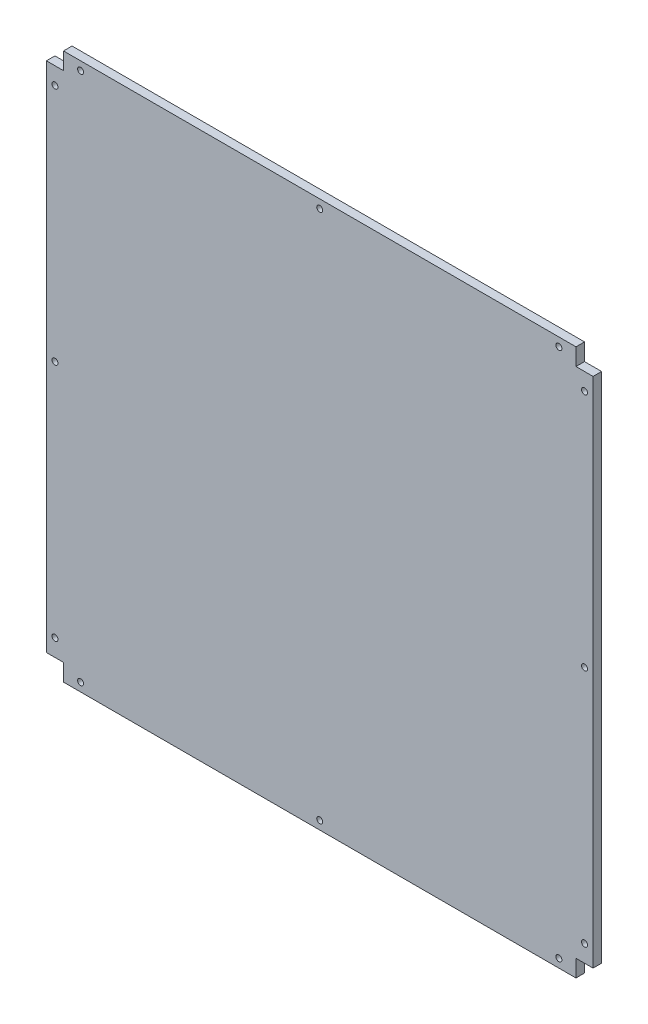
ISO-10303-21;
HEADER;
FILE_DESCRIPTION(('STEP AP214'),'2;1');
FILE_NAME('part.step','',(''),(''),'','','');
FILE_SCHEMA(('AUTOMOTIVE_DESIGN { 1 0 10303 214 1 1 1 1 }'));
ENDSEC;
DATA;
#1=APPLICATION_CONTEXT('core data for automotive mechanical design processes');
#2=APPLICATION_PROTOCOL_DEFINITION('international standard','automotive_design',2000,#1);
#3=PRODUCT_CONTEXT('',#1,'mechanical');
#4=PRODUCT('Part','Part','',(#3));
#5=PRODUCT_RELATED_PRODUCT_CATEGORY('part','',(#4));
#6=PRODUCT_DEFINITION_FORMATION('','',#4);
#7=PRODUCT_DEFINITION_CONTEXT('part definition',#1,'design');
#8=PRODUCT_DEFINITION('design','',#6,#7);
#9=PRODUCT_DEFINITION_SHAPE('','',#8);
#10=(LENGTH_UNIT() NAMED_UNIT(*) SI_UNIT(.MILLI.,.METRE.));
#11=(NAMED_UNIT(*) PLANE_ANGLE_UNIT() SI_UNIT($,.RADIAN.));
#12=(NAMED_UNIT(*) SI_UNIT($,.STERADIAN.) SOLID_ANGLE_UNIT());
#13=UNCERTAINTY_MEASURE_WITH_UNIT(LENGTH_MEASURE(1.E-05),#10,'distance_accuracy_value','');
#14=(GEOMETRIC_REPRESENTATION_CONTEXT(3) GLOBAL_UNCERTAINTY_ASSIGNED_CONTEXT((#13)) GLOBAL_UNIT_ASSIGNED_CONTEXT((#10,
#11,#12)) REPRESENTATION_CONTEXT('',''));
#15=CARTESIAN_POINT('',(0.,0.,0.));
#16=DIRECTION('',(0.,0.,1.));
#17=DIRECTION('',(1.,0.,0.));
#18=AXIS2_PLACEMENT_3D('',#15,#16,#17);
#19=CARTESIAN_POINT('',(0.,0.,5.));
#20=DIRECTION('',(0.,0.,1.));
#21=DIRECTION('',(1.,0.,0.));
#22=AXIS2_PLACEMENT_3D('',#19,#20,#21);
#23=PLANE('',#22);
#24=CARTESIAN_POINT('',(305.000000000002,-149.999999999996,5.));
#25=DIRECTION('',(0.,0.,1.));
#26=DIRECTION('',(1.,0.,0.));
#27=AXIS2_PLACEMENT_3D('',#24,#25,#26);
#28=CIRCLE('',#27,1.75000000000003);
#29=CARTESIAN_POINT('',(306.750000000002,-149.999999999996,5.));
#30=VERTEX_POINT('',#29);
#31=EDGE_CURVE('E364',#30,#30,#28,.T.);
#32=ORIENTED_EDGE('',*,*,#31,.F.);
#33=EDGE_LOOP('',(#32));
#34=FACE_BOUND('',#33,.T.);
#35=CARTESIAN_POINT('',(10.0000000000054,-305.000000000001,5.));
#36=DIRECTION('',(0.,0.,1.));
#37=DIRECTION('',(1.,0.,0.));
#38=AXIS2_PLACEMENT_3D('',#35,#36,#37);
#39=CIRCLE('',#38,1.74999999999998);
#40=CARTESIAN_POINT('',(11.7500000000054,-305.000000000001,5.));
#41=VERTEX_POINT('',#40);
#42=EDGE_CURVE('E380',#41,#41,#39,.T.);
#43=ORIENTED_EDGE('',*,*,#42,.F.);
#44=EDGE_LOOP('',(#43));
#45=FACE_BOUND('',#44,.T.);
#46=CARTESIAN_POINT('',(290.000000000005,-304.999999999999,5.));
#47=DIRECTION('',(0.,0.,1.));
#48=DIRECTION('',(1.,0.,0.));
#49=AXIS2_PLACEMENT_3D('',#46,#47,#48);
#50=CIRCLE('',#49,1.74999999999998);
#51=CARTESIAN_POINT('',(291.750000000005,-304.999999999999,5.));
#52=VERTEX_POINT('',#51);
#53=EDGE_CURVE('E396',#52,#52,#50,.T.);
#54=ORIENTED_EDGE('',*,*,#53,.F.);
#55=EDGE_LOOP('',(#54));
#56=FACE_BOUND('',#55,.T.);
#57=CARTESIAN_POINT('',(-4.99999999999786,-150.000000000003,5.));
#58=DIRECTION('',(0.,0.,1.));
#59=DIRECTION('',(1.,0.,0.));
#60=AXIS2_PLACEMENT_3D('',#57,#58,#59);
#61=CIRCLE('',#60,1.75000000000001);
#62=CARTESIAN_POINT('',(-3.24999999999785,-150.000000000003,5.));
#63=VERTEX_POINT('',#62);
#64=EDGE_CURVE('E412',#63,#63,#61,.T.);
#65=ORIENTED_EDGE('',*,*,#64,.F.);
#66=EDGE_LOOP('',(#65));
#67=FACE_BOUND('',#66,.T.);
#68=CARTESIAN_POINT('',(290.,5.,5.));
#69=DIRECTION('',(0.,0.,1.));
#70=DIRECTION('',(1.,0.,0.));
#71=AXIS2_PLACEMENT_3D('',#68,#69,#70);
#72=CIRCLE('',#71,1.74999999999998);
#73=CARTESIAN_POINT('',(291.75,5.,5.));
#74=VERTEX_POINT('',#73);
#75=EDGE_CURVE('E428',#74,#74,#72,.T.);
#76=ORIENTED_EDGE('',*,*,#75,.F.);
#77=EDGE_LOOP('',(#76));
#78=FACE_BOUND('',#77,.T.);
#79=CARTESIAN_POINT('',(10.,5.,5.));
#80=DIRECTION('',(0.,0.,1.));
#81=DIRECTION('',(1.,0.,0.));
#82=AXIS2_PLACEMENT_3D('',#79,#80,#81);
#83=CIRCLE('',#82,1.75);
#84=CARTESIAN_POINT('',(11.75,5.,5.));
#85=VERTEX_POINT('',#84);
#86=EDGE_CURVE('E170',#85,#85,#83,.T.);
#87=ORIENTED_EDGE('',*,*,#86,.F.);
#88=EDGE_LOOP('',(#87));
#89=FACE_BOUND('',#88,.T.);
#90=DIRECTION('',(-1.,0.,0.));
#91=VECTOR('',#90,1.);
#92=CARTESIAN_POINT('',(-9.99999999999996,0.,5.));
#93=LINE('',#92,#91);
#94=CARTESIAN_POINT('',(0.,0.,5.));
#95=VERTEX_POINT('',#94);
#96=CARTESIAN_POINT('',(-9.99999999999996,0.,5.));
#97=VERTEX_POINT('',#96);
#98=EDGE_CURVE('E200',#95,#97,#93,.T.);
#99=ORIENTED_EDGE('',*,*,#98,.T.);
#100=DIRECTION('',(0.,-1.,0.));
#101=VECTOR('',#100,1.);
#102=CARTESIAN_POINT('',(-9.99999999999996,-300.,5.));
#103=LINE('',#102,#101);
#104=CARTESIAN_POINT('',(-9.99999999999996,-300.,5.));
#105=VERTEX_POINT('',#104);
#106=EDGE_CURVE('E112',#97,#105,#103,.T.);
#107=ORIENTED_EDGE('',*,*,#106,.T.);
#108=DIRECTION('',(1.,0.,0.));
#109=VECTOR('',#108,1.);
#110=CARTESIAN_POINT('',(0.,-300.,5.));
#111=LINE('',#110,#109);
#112=CARTESIAN_POINT('',(0.,-300.,5.));
#113=VERTEX_POINT('',#112);
#114=EDGE_CURVE('E237',#105,#113,#111,.T.);
#115=ORIENTED_EDGE('',*,*,#114,.T.);
#116=DIRECTION('',(0.,-1.,0.));
#117=VECTOR('',#116,1.);
#118=CARTESIAN_POINT('',(0.,-310.,5.));
#119=LINE('',#118,#117);
#120=CARTESIAN_POINT('',(0.,-310.,5.));
#121=VERTEX_POINT('',#120);
#122=EDGE_CURVE('E257',#113,#121,#119,.T.);
#123=ORIENTED_EDGE('',*,*,#122,.T.);
#124=DIRECTION('',(1.,0.,0.));
#125=VECTOR('',#124,1.);
#126=CARTESIAN_POINT('',(300.,-310.,5.));
#127=LINE('',#126,#125);
#128=CARTESIAN_POINT('',(300.,-310.,5.));
#129=VERTEX_POINT('',#128);
#130=EDGE_CURVE('E253',#121,#129,#127,.T.);
#131=ORIENTED_EDGE('',*,*,#130,.T.);
#132=DIRECTION('',(0.,1.,0.));
#133=VECTOR('',#132,1.);
#134=CARTESIAN_POINT('',(300.,-300.,5.));
#135=LINE('',#134,#133);
#136=CARTESIAN_POINT('',(300.,-300.,5.));
#137=VERTEX_POINT('',#136);
#138=EDGE_CURVE('E256',#129,#137,#135,.T.);
#139=ORIENTED_EDGE('',*,*,#138,.T.);
#140=DIRECTION('',(1.,0.,0.));
#141=VECTOR('',#140,1.);
#142=CARTESIAN_POINT('',(310.,-300.,5.));
#143=LINE('',#142,#141);
#144=CARTESIAN_POINT('',(310.,-300.,5.));
#145=VERTEX_POINT('',#144);
#146=EDGE_CURVE('E261',#137,#145,#143,.T.);
#147=ORIENTED_EDGE('',*,*,#146,.T.);
#148=DIRECTION('',(0.,1.,0.));
#149=VECTOR('',#148,1.);
#150=CARTESIAN_POINT('',(310.,0.,5.));
#151=LINE('',#150,#149);
#152=CARTESIAN_POINT('',(310.,0.,5.));
#153=VERTEX_POINT('',#152);
#154=EDGE_CURVE('E268',#145,#153,#151,.T.);
#155=ORIENTED_EDGE('',*,*,#154,.T.);
#156=DIRECTION('',(-1.,0.,0.));
#157=VECTOR('',#156,1.);
#158=CARTESIAN_POINT('',(300.,0.,5.));
#159=LINE('',#158,#157);
#160=CARTESIAN_POINT('',(300.,0.,5.));
#161=VERTEX_POINT('',#160);
#162=EDGE_CURVE('E143',#153,#161,#159,.T.);
#163=ORIENTED_EDGE('',*,*,#162,.T.);
#164=DIRECTION('',(0.,1.,0.));
#165=VECTOR('',#164,1.);
#166=CARTESIAN_POINT('',(300.,10.,5.));
#167=LINE('',#166,#165);
#168=CARTESIAN_POINT('',(300.,10.,5.));
#169=VERTEX_POINT('',#168);
#170=EDGE_CURVE('E137',#161,#169,#167,.T.);
#171=ORIENTED_EDGE('',*,*,#170,.T.);
#172=DIRECTION('',(-1.,0.,0.));
#173=VECTOR('',#172,1.);
#174=CARTESIAN_POINT('',(0.,10.,5.));
#175=LINE('',#174,#173);
#176=CARTESIAN_POINT('',(0.,10.,5.));
#177=VERTEX_POINT('',#176);
#178=EDGE_CURVE('E141',#169,#177,#175,.T.);
#179=ORIENTED_EDGE('',*,*,#178,.T.);
#180=DIRECTION('',(0.,-1.,0.));
#181=VECTOR('',#180,1.);
#182=CARTESIAN_POINT('',(0.,0.,5.));
#183=LINE('',#182,#181);
#184=EDGE_CURVE('E57',#177,#95,#183,.T.);
#185=ORIENTED_EDGE('',*,*,#184,.T.);
#186=EDGE_LOOP('',(#99,#107,#115,#123,#131,#139,#147,#155,#163,#171,#179,#185));
#187=FACE_BOUND('',#186,.T.);
#188=CARTESIAN_POINT('',(150.,5.,5.));
#189=DIRECTION('',(0.,0.,1.));
#190=DIRECTION('',(1.,0.,0.));
#191=AXIS2_PLACEMENT_3D('',#188,#189,#190);
#192=CIRCLE('',#191,1.75000000000001);
#193=CARTESIAN_POINT('',(151.75,5.,5.));
#194=VERTEX_POINT('',#193);
#195=EDGE_CURVE('E436',#194,#194,#192,.T.);
#196=ORIENTED_EDGE('',*,*,#195,.F.);
#197=EDGE_LOOP('',(#196));
#198=FACE_BOUND('',#197,.T.);
#199=CARTESIAN_POINT('',(-4.99999999999737,-290.000000000003,5.));
#200=DIRECTION('',(0.,0.,1.));
#201=DIRECTION('',(1.,0.,0.));
#202=AXIS2_PLACEMENT_3D('',#199,#200,#201);
#203=CIRCLE('',#202,1.74999999999999);
#204=CARTESIAN_POINT('',(-3.24999999999739,-290.000000000003,5.));
#205=VERTEX_POINT('',#204);
#206=EDGE_CURVE('E420',#205,#205,#203,.T.);
#207=ORIENTED_EDGE('',*,*,#206,.F.);
#208=EDGE_LOOP('',(#207));
#209=FACE_BOUND('',#208,.T.);
#210=CARTESIAN_POINT('',(-4.99999999999835,-10.0000000000027,5.));
#211=DIRECTION('',(0.,0.,1.));
#212=DIRECTION('',(1.,0.,0.));
#213=AXIS2_PLACEMENT_3D('',#210,#211,#212);
#214=CIRCLE('',#213,1.74999999999998);
#215=CARTESIAN_POINT('',(-3.24999999999836,-10.0000000000027,5.));
#216=VERTEX_POINT('',#215);
#217=EDGE_CURVE('E404',#216,#216,#214,.T.);
#218=ORIENTED_EDGE('',*,*,#217,.F.);
#219=EDGE_LOOP('',(#218));
#220=FACE_BOUND('',#219,.T.);
#221=CARTESIAN_POINT('',(150.000000000005,-305.,5.));
#222=DIRECTION('',(0.,0.,1.));
#223=DIRECTION('',(1.,0.,0.));
#224=AXIS2_PLACEMENT_3D('',#221,#222,#223);
#225=CIRCLE('',#224,1.75000000000001);
#226=CARTESIAN_POINT('',(151.750000000005,-305.,5.));
#227=VERTEX_POINT('',#226);
#228=EDGE_CURVE('E388',#227,#227,#225,.T.);
#229=ORIENTED_EDGE('',*,*,#228,.F.);
#230=EDGE_LOOP('',(#229));
#231=FACE_BOUND('',#230,.T.);
#232=CARTESIAN_POINT('',(305.000000000001,-9.9999999999962,5.));
#233=DIRECTION('',(0.,0.,1.));
#234=DIRECTION('',(1.,0.,0.));
#235=AXIS2_PLACEMENT_3D('',#232,#233,#234);
#236=CIRCLE('',#235,1.75);
#237=CARTESIAN_POINT('',(306.750000000001,-9.9999999999962,5.));
#238=VERTEX_POINT('',#237);
#239=EDGE_CURVE('E372',#238,#238,#236,.T.);
#240=ORIENTED_EDGE('',*,*,#239,.F.);
#241=EDGE_LOOP('',(#240));
#242=FACE_BOUND('',#241,.T.);
#243=CARTESIAN_POINT('',(305.000000000004,-289.999999999996,5.));
#244=DIRECTION('',(0.,0.,1.));
#245=DIRECTION('',(1.,0.,0.));
#246=AXIS2_PLACEMENT_3D('',#243,#244,#245);
#247=CIRCLE('',#246,1.74999999999998);
#248=CARTESIAN_POINT('',(306.750000000004,-289.999999999996,5.));
#249=VERTEX_POINT('',#248);
#250=EDGE_CURVE('E353',#249,#249,#247,.T.);
#251=ORIENTED_EDGE('',*,*,#250,.F.);
#252=EDGE_LOOP('',(#251));
#253=FACE_BOUND('',#252,.T.);
#254=ADVANCED_FACE('F39',(#34,#45,#56,#67,#78,#89,#187,#198,#209,#220,#231,#242,#253),#23,.T.);
#255=CARTESIAN_POINT('',(0.,0.,0.));
#256=DIRECTION('',(0.,0.,1.));
#257=DIRECTION('',(1.,0.,0.));
#258=AXIS2_PLACEMENT_3D('',#255,#256,#257);
#259=PLANE('',#258);
#260=DIRECTION('',(-1.,0.,0.));
#261=VECTOR('',#260,1.);
#262=CARTESIAN_POINT('',(-9.99999999999996,0.,0.));
#263=LINE('',#262,#261);
#264=CARTESIAN_POINT('',(0.,0.,0.));
#265=VERTEX_POINT('',#264);
#266=CARTESIAN_POINT('',(-9.99999999999996,0.,0.));
#267=VERTEX_POINT('',#266);
#268=EDGE_CURVE('E165',#265,#267,#263,.T.);
#269=ORIENTED_EDGE('',*,*,#268,.F.);
#270=DIRECTION('',(0.,-1.,0.));
#271=VECTOR('',#270,1.);
#272=CARTESIAN_POINT('',(0.,0.,0.));
#273=LINE('',#272,#271);
#274=CARTESIAN_POINT('',(0.,10.,0.));
#275=VERTEX_POINT('',#274);
#276=EDGE_CURVE('E104',#275,#265,#273,.T.);
#277=ORIENTED_EDGE('',*,*,#276,.F.);
#278=DIRECTION('',(-1.,0.,0.));
#279=VECTOR('',#278,1.);
#280=CARTESIAN_POINT('',(0.,10.,0.));
#281=LINE('',#280,#279);
#282=CARTESIAN_POINT('',(300.,10.,0.));
#283=VERTEX_POINT('',#282);
#284=EDGE_CURVE('E98',#283,#275,#281,.T.);
#285=ORIENTED_EDGE('',*,*,#284,.F.);
#286=DIRECTION('',(0.,1.,0.));
#287=VECTOR('',#286,1.);
#288=CARTESIAN_POINT('',(300.,10.,0.));
#289=LINE('',#288,#287);
#290=CARTESIAN_POINT('',(300.,0.,0.));
#291=VERTEX_POINT('',#290);
#292=EDGE_CURVE('E152',#291,#283,#289,.T.);
#293=ORIENTED_EDGE('',*,*,#292,.F.);
#294=DIRECTION('',(-1.,0.,0.));
#295=VECTOR('',#294,1.);
#296=CARTESIAN_POINT('',(300.,0.,0.));
#297=LINE('',#296,#295);
#298=CARTESIAN_POINT('',(310.,0.,0.));
#299=VERTEX_POINT('',#298);
#300=EDGE_CURVE('E191',#299,#291,#297,.T.);
#301=ORIENTED_EDGE('',*,*,#300,.F.);
#302=DIRECTION('',(0.,1.,0.));
#303=VECTOR('',#302,1.);
#304=CARTESIAN_POINT('',(310.,0.,0.));
#305=LINE('',#304,#303);
#306=CARTESIAN_POINT('',(310.,-300.,0.));
#307=VERTEX_POINT('',#306);
#308=EDGE_CURVE('E188',#307,#299,#305,.T.);
#309=ORIENTED_EDGE('',*,*,#308,.F.);
#310=DIRECTION('',(1.,0.,0.));
#311=VECTOR('',#310,1.);
#312=CARTESIAN_POINT('',(310.,-300.,0.));
#313=LINE('',#312,#311);
#314=CARTESIAN_POINT('',(300.,-300.,0.));
#315=VERTEX_POINT('',#314);
#316=EDGE_CURVE('E185',#315,#307,#313,.T.);
#317=ORIENTED_EDGE('',*,*,#316,.F.);
#318=DIRECTION('',(0.,1.,0.));
#319=VECTOR('',#318,1.);
#320=CARTESIAN_POINT('',(300.,-300.,0.));
#321=LINE('',#320,#319);
#322=CARTESIAN_POINT('',(300.,-310.,0.));
#323=VERTEX_POINT('',#322);
#324=EDGE_CURVE('E182',#323,#315,#321,.T.);
#325=ORIENTED_EDGE('',*,*,#324,.F.);
#326=DIRECTION('',(1.,0.,0.));
#327=VECTOR('',#326,1.);
#328=CARTESIAN_POINT('',(300.,-310.,0.));
#329=LINE('',#328,#327);
#330=CARTESIAN_POINT('',(0.,-310.,0.));
#331=VERTEX_POINT('',#330);
#332=EDGE_CURVE('E179',#331,#323,#329,.T.);
#333=ORIENTED_EDGE('',*,*,#332,.F.);
#334=DIRECTION('',(0.,-1.,0.));
#335=VECTOR('',#334,1.);
#336=CARTESIAN_POINT('',(0.,-310.,0.));
#337=LINE('',#336,#335);
#338=CARTESIAN_POINT('',(0.,-300.,0.));
#339=VERTEX_POINT('',#338);
#340=EDGE_CURVE('E176',#339,#331,#337,.T.);
#341=ORIENTED_EDGE('',*,*,#340,.F.);
#342=DIRECTION('',(1.,0.,0.));
#343=VECTOR('',#342,1.);
#344=CARTESIAN_POINT('',(0.,-300.,0.));
#345=LINE('',#344,#343);
#346=CARTESIAN_POINT('',(-9.99999999999996,-300.,0.));
#347=VERTEX_POINT('',#346);
#348=EDGE_CURVE('E173',#347,#339,#345,.T.);
#349=ORIENTED_EDGE('',*,*,#348,.F.);
#350=DIRECTION('',(0.,-1.,0.));
#351=VECTOR('',#350,1.);
#352=CARTESIAN_POINT('',(-9.99999999999996,-300.,0.));
#353=LINE('',#352,#351);
#354=EDGE_CURVE('E169',#267,#347,#353,.T.);
#355=ORIENTED_EDGE('',*,*,#354,.F.);
#356=EDGE_LOOP('',(#269,#277,#285,#293,#301,#309,#317,#325,#333,#341,#349,#355));
#357=FACE_BOUND('',#356,.T.);
#358=CARTESIAN_POINT('',(10.,5.,0.));
#359=DIRECTION('',(0.,0.,1.));
#360=DIRECTION('',(1.,0.,0.));
#361=AXIS2_PLACEMENT_3D('',#358,#359,#360);
#362=CIRCLE('',#361,1.75);
#363=CARTESIAN_POINT('',(11.75,5.,0.));
#364=VERTEX_POINT('',#363);
#365=EDGE_CURVE('E440',#364,#364,#362,.T.);
#366=ORIENTED_EDGE('',*,*,#365,.T.);
#367=EDGE_LOOP('',(#366));
#368=FACE_BOUND('',#367,.T.);
#369=CARTESIAN_POINT('',(150.,5.,0.));
#370=DIRECTION('',(0.,0.,1.));
#371=DIRECTION('',(1.,0.,0.));
#372=AXIS2_PLACEMENT_3D('',#369,#370,#371);
#373=CIRCLE('',#372,1.75000000000001);
#374=CARTESIAN_POINT('',(151.75,5.,0.));
#375=VERTEX_POINT('',#374);
#376=EDGE_CURVE('E432',#375,#375,#373,.T.);
#377=ORIENTED_EDGE('',*,*,#376,.T.);
#378=EDGE_LOOP('',(#377));
#379=FACE_BOUND('',#378,.T.);
#380=CARTESIAN_POINT('',(290.,5.,0.));
#381=DIRECTION('',(0.,0.,1.));
#382=DIRECTION('',(1.,0.,0.));
#383=AXIS2_PLACEMENT_3D('',#380,#381,#382);
#384=CIRCLE('',#383,1.74999999999998);
#385=CARTESIAN_POINT('',(291.75,5.,0.));
#386=VERTEX_POINT('',#385);
#387=EDGE_CURVE('E424',#386,#386,#384,.T.);
#388=ORIENTED_EDGE('',*,*,#387,.T.);
#389=EDGE_LOOP('',(#388));
#390=FACE_BOUND('',#389,.T.);
#391=CARTESIAN_POINT('',(-4.99999999999737,-290.000000000003,0.));
#392=DIRECTION('',(0.,0.,1.));
#393=DIRECTION('',(1.,0.,0.));
#394=AXIS2_PLACEMENT_3D('',#391,#392,#393);
#395=CIRCLE('',#394,1.74999999999999);
#396=CARTESIAN_POINT('',(-3.24999999999739,-290.000000000003,0.));
#397=VERTEX_POINT('',#396);
#398=EDGE_CURVE('E416',#397,#397,#395,.T.);
#399=ORIENTED_EDGE('',*,*,#398,.T.);
#400=EDGE_LOOP('',(#399));
#401=FACE_BOUND('',#400,.T.);
#402=CARTESIAN_POINT('',(-4.99999999999786,-150.000000000003,0.));
#403=DIRECTION('',(0.,0.,1.));
#404=DIRECTION('',(1.,0.,0.));
#405=AXIS2_PLACEMENT_3D('',#402,#403,#404);
#406=CIRCLE('',#405,1.75000000000001);
#407=CARTESIAN_POINT('',(-3.24999999999785,-150.000000000003,0.));
#408=VERTEX_POINT('',#407);
#409=EDGE_CURVE('E408',#408,#408,#406,.T.);
#410=ORIENTED_EDGE('',*,*,#409,.T.);
#411=EDGE_LOOP('',(#410));
#412=FACE_BOUND('',#411,.T.);
#413=CARTESIAN_POINT('',(-4.99999999999835,-10.0000000000027,0.));
#414=DIRECTION('',(0.,0.,1.));
#415=DIRECTION('',(1.,0.,0.));
#416=AXIS2_PLACEMENT_3D('',#413,#414,#415);
#417=CIRCLE('',#416,1.74999999999998);
#418=CARTESIAN_POINT('',(-3.24999999999836,-10.0000000000027,0.));
#419=VERTEX_POINT('',#418);
#420=EDGE_CURVE('E400',#419,#419,#417,.T.);
#421=ORIENTED_EDGE('',*,*,#420,.T.);
#422=EDGE_LOOP('',(#421));
#423=FACE_BOUND('',#422,.T.);
#424=CARTESIAN_POINT('',(290.000000000005,-304.999999999999,0.));
#425=DIRECTION('',(0.,0.,1.));
#426=DIRECTION('',(1.,0.,0.));
#427=AXIS2_PLACEMENT_3D('',#424,#425,#426);
#428=CIRCLE('',#427,1.74999999999998);
#429=CARTESIAN_POINT('',(291.750000000005,-304.999999999999,0.));
#430=VERTEX_POINT('',#429);
#431=EDGE_CURVE('E392',#430,#430,#428,.T.);
#432=ORIENTED_EDGE('',*,*,#431,.T.);
#433=EDGE_LOOP('',(#432));
#434=FACE_BOUND('',#433,.T.);
#435=CARTESIAN_POINT('',(150.000000000005,-305.,0.));
#436=DIRECTION('',(0.,0.,1.));
#437=DIRECTION('',(1.,0.,0.));
#438=AXIS2_PLACEMENT_3D('',#435,#436,#437);
#439=CIRCLE('',#438,1.75000000000001);
#440=CARTESIAN_POINT('',(151.750000000005,-305.,0.));
#441=VERTEX_POINT('',#440);
#442=EDGE_CURVE('E384',#441,#441,#439,.T.);
#443=ORIENTED_EDGE('',*,*,#442,.T.);
#444=EDGE_LOOP('',(#443));
#445=FACE_BOUND('',#444,.T.);
#446=CARTESIAN_POINT('',(10.0000000000054,-305.000000000001,0.));
#447=DIRECTION('',(0.,0.,1.));
#448=DIRECTION('',(1.,0.,0.));
#449=AXIS2_PLACEMENT_3D('',#446,#447,#448);
#450=CIRCLE('',#449,1.74999999999998);
#451=CARTESIAN_POINT('',(11.7500000000054,-305.000000000001,0.));
#452=VERTEX_POINT('',#451);
#453=EDGE_CURVE('E376',#452,#452,#450,.T.);
#454=ORIENTED_EDGE('',*,*,#453,.T.);
#455=EDGE_LOOP('',(#454));
#456=FACE_BOUND('',#455,.T.);
#457=CARTESIAN_POINT('',(305.000000000001,-9.9999999999962,0.));
#458=DIRECTION('',(0.,0.,1.));
#459=DIRECTION('',(1.,0.,0.));
#460=AXIS2_PLACEMENT_3D('',#457,#458,#459);
#461=CIRCLE('',#460,1.75);
#462=CARTESIAN_POINT('',(306.750000000001,-9.9999999999962,0.));
#463=VERTEX_POINT('',#462);
#464=EDGE_CURVE('E368',#463,#463,#461,.T.);
#465=ORIENTED_EDGE('',*,*,#464,.T.);
#466=EDGE_LOOP('',(#465));
#467=FACE_BOUND('',#466,.T.);
#468=CARTESIAN_POINT('',(305.000000000002,-149.999999999996,0.));
#469=DIRECTION('',(0.,0.,1.));
#470=DIRECTION('',(1.,0.,0.));
#471=AXIS2_PLACEMENT_3D('',#468,#469,#470);
#472=CIRCLE('',#471,1.75000000000003);
#473=CARTESIAN_POINT('',(306.750000000002,-149.999999999996,0.));
#474=VERTEX_POINT('',#473);
#475=EDGE_CURVE('E361',#474,#474,#472,.T.);
#476=ORIENTED_EDGE('',*,*,#475,.T.);
#477=EDGE_LOOP('',(#476));
#478=FACE_BOUND('',#477,.T.);
#479=CARTESIAN_POINT('',(305.000000000004,-289.999999999996,0.));
#480=DIRECTION('',(0.,0.,1.));
#481=DIRECTION('',(1.,0.,0.));
#482=AXIS2_PLACEMENT_3D('',#479,#480,#481);
#483=CIRCLE('',#482,1.74999999999998);
#484=CARTESIAN_POINT('',(306.750000000004,-289.999999999996,0.));
#485=VERTEX_POINT('',#484);
#486=EDGE_CURVE('E356',#485,#485,#483,.T.);
#487=ORIENTED_EDGE('',*,*,#486,.T.);
#488=EDGE_LOOP('',(#487));
#489=FACE_BOUND('',#488,.T.);
#490=ADVANCED_FACE('F241',(#357,#368,#379,#390,#401,#412,#423,#434,#445,#456,#467,#478,#489),
#259,.F.);
#491=CARTESIAN_POINT('',(-9.99999999999996,0.,5.));
#492=DIRECTION('',(0.,-1.,0.));
#493=DIRECTION('',(0.,0.,-1.));
#494=AXIS2_PLACEMENT_3D('',#491,#492,#493);
#495=PLANE('',#494);
#496=ORIENTED_EDGE('',*,*,#268,.T.);
#497=DIRECTION('',(0.,0.,-1.));
#498=VECTOR('',#497,1.);
#499=CARTESIAN_POINT('',(-9.99999999999996,0.,5.));
#500=LINE('',#499,#498);
#501=EDGE_CURVE('E11',#97,#267,#500,.T.);
#502=ORIENTED_EDGE('',*,*,#501,.F.);
#503=ORIENTED_EDGE('',*,*,#98,.F.);
#504=DIRECTION('',(0.,0.,-1.));
#505=VECTOR('',#504,1.);
#506=CARTESIAN_POINT('',(0.,0.,5.));
#507=LINE('',#506,#505);
#508=EDGE_CURVE('E161',#95,#265,#507,.T.);
#509=ORIENTED_EDGE('',*,*,#508,.T.);
#510=EDGE_LOOP('',(#496,#502,#503,#509));
#511=FACE_BOUND('',#510,.T.);
#512=ADVANCED_FACE('F41',(#511),#495,.F.);
#513=CARTESIAN_POINT('',(-9.99999999999996,-300.,5.));
#514=DIRECTION('',(1.,0.,0.));
#515=DIRECTION('',(0.,0.,-1.));
#516=AXIS2_PLACEMENT_3D('',#513,#514,#515);
#517=PLANE('',#516);
#518=ORIENTED_EDGE('',*,*,#354,.T.);
#519=DIRECTION('',(0.,0.,-1.));
#520=VECTOR('',#519,1.);
#521=CARTESIAN_POINT('',(-9.99999999999996,-300.,5.));
#522=LINE('',#521,#520);
#523=EDGE_CURVE('E49',#105,#347,#522,.T.);
#524=ORIENTED_EDGE('',*,*,#523,.F.);
#525=ORIENTED_EDGE('',*,*,#106,.F.);
#526=ORIENTED_EDGE('',*,*,#501,.T.);
#527=EDGE_LOOP('',(#518,#524,#525,#526));
#528=FACE_BOUND('',#527,.T.);
#529=ADVANCED_FACE('F628',(#528),#517,.F.);
#530=CARTESIAN_POINT('',(0.,-300.,5.));
#531=DIRECTION('',(0.,1.,0.));
#532=DIRECTION('',(0.,0.,1.));
#533=AXIS2_PLACEMENT_3D('',#530,#531,#532);
#534=PLANE('',#533);
#535=ORIENTED_EDGE('',*,*,#348,.T.);
#536=DIRECTION('',(0.,0.,-1.));
#537=VECTOR('',#536,1.);
#538=CARTESIAN_POINT('',(0.,-300.,5.));
#539=LINE('',#538,#537);
#540=EDGE_CURVE('E227',#113,#339,#539,.T.);
#541=ORIENTED_EDGE('',*,*,#540,.F.);
#542=ORIENTED_EDGE('',*,*,#114,.F.);
#543=ORIENTED_EDGE('',*,*,#523,.T.);
#544=EDGE_LOOP('',(#535,#541,#542,#543));
#545=FACE_BOUND('',#544,.T.);
#546=ADVANCED_FACE('F235',(#545),#534,.F.);
#547=CARTESIAN_POINT('',(0.,-310.,5.));
#548=DIRECTION('',(1.,0.,0.));
#549=DIRECTION('',(0.,1.,0.));
#550=AXIS2_PLACEMENT_3D('',#547,#548,#549);
#551=PLANE('',#550);
#552=ORIENTED_EDGE('',*,*,#340,.T.);
#553=DIRECTION('',(0.,0.,-1.));
#554=VECTOR('',#553,1.);
#555=CARTESIAN_POINT('',(0.,-310.,5.));
#556=LINE('',#555,#554);
#557=EDGE_CURVE('E223',#121,#331,#556,.T.);
#558=ORIENTED_EDGE('',*,*,#557,.F.);
#559=ORIENTED_EDGE('',*,*,#122,.F.);
#560=ORIENTED_EDGE('',*,*,#540,.T.);
#561=EDGE_LOOP('',(#552,#558,#559,#560));
#562=FACE_BOUND('',#561,.T.);
#563=ADVANCED_FACE('F247',(#562),#551,.F.);
#564=CARTESIAN_POINT('',(300.,-310.,5.));
#565=DIRECTION('',(0.,1.,0.));
#566=DIRECTION('',(-1.,0.,0.));
#567=AXIS2_PLACEMENT_3D('',#564,#565,#566);
#568=PLANE('',#567);
#569=ORIENTED_EDGE('',*,*,#332,.T.);
#570=DIRECTION('',(0.,0.,-1.));
#571=VECTOR('',#570,1.);
#572=CARTESIAN_POINT('',(300.,-310.,5.));
#573=LINE('',#572,#571);
#574=EDGE_CURVE('E219',#129,#323,#573,.T.);
#575=ORIENTED_EDGE('',*,*,#574,.F.);
#576=ORIENTED_EDGE('',*,*,#130,.F.);
#577=ORIENTED_EDGE('',*,*,#557,.T.);
#578=EDGE_LOOP('',(#569,#575,#576,#577));
#579=FACE_BOUND('',#578,.T.);
#580=ADVANCED_FACE('F251',(#579),#568,.F.);
#581=CARTESIAN_POINT('',(300.,-300.,5.));
#582=DIRECTION('',(-1.,0.,0.));
#583=DIRECTION('',(0.,0.,1.));
#584=AXIS2_PLACEMENT_3D('',#581,#582,#583);
#585=PLANE('',#584);
#586=ORIENTED_EDGE('',*,*,#324,.T.);
#587=DIRECTION('',(0.,0.,-1.));
#588=VECTOR('',#587,1.);
#589=CARTESIAN_POINT('',(300.,-300.,5.));
#590=LINE('',#589,#588);
#591=EDGE_CURVE('E215',#137,#315,#590,.T.);
#592=ORIENTED_EDGE('',*,*,#591,.F.);
#593=ORIENTED_EDGE('',*,*,#138,.F.);
#594=ORIENTED_EDGE('',*,*,#574,.T.);
#595=EDGE_LOOP('',(#586,#592,#593,#594));
#596=FACE_BOUND('',#595,.T.);
#597=ADVANCED_FACE('F593',(#596),#585,.F.);
#598=CARTESIAN_POINT('',(310.,-300.,5.));
#599=DIRECTION('',(0.,1.,0.));
#600=DIRECTION('',(0.,0.,1.));
#601=AXIS2_PLACEMENT_3D('',#598,#599,#600);
#602=PLANE('',#601);
#603=ORIENTED_EDGE('',*,*,#316,.T.);
#604=DIRECTION('',(0.,0.,-1.));
#605=VECTOR('',#604,1.);
#606=CARTESIAN_POINT('',(310.,-300.,5.));
#607=LINE('',#606,#605);
#608=EDGE_CURVE('E211',#145,#307,#607,.T.);
#609=ORIENTED_EDGE('',*,*,#608,.F.);
#610=ORIENTED_EDGE('',*,*,#146,.F.);
#611=ORIENTED_EDGE('',*,*,#591,.T.);
#612=EDGE_LOOP('',(#603,#609,#610,#611));
#613=FACE_BOUND('',#612,.T.);
#614=ADVANCED_FACE('F584',(#613),#602,.F.);
#615=CARTESIAN_POINT('',(310.,0.,5.));
#616=DIRECTION('',(-1.,0.,0.));
#617=DIRECTION('',(0.,-1.,0.));
#618=AXIS2_PLACEMENT_3D('',#615,#616,#617);
#619=PLANE('',#618);
#620=ORIENTED_EDGE('',*,*,#308,.T.);
#621=DIRECTION('',(0.,0.,-1.));
#622=VECTOR('',#621,1.);
#623=CARTESIAN_POINT('',(310.,0.,5.));
#624=LINE('',#623,#622);
#625=EDGE_CURVE('E207',#153,#299,#624,.T.);
#626=ORIENTED_EDGE('',*,*,#625,.F.);
#627=ORIENTED_EDGE('',*,*,#154,.F.);
#628=ORIENTED_EDGE('',*,*,#608,.T.);
#629=EDGE_LOOP('',(#620,#626,#627,#628));
#630=FACE_BOUND('',#629,.T.);
#631=ADVANCED_FACE('F276',(#630),#619,.F.);
#632=CARTESIAN_POINT('',(300.,0.,5.));
#633=DIRECTION('',(0.,-1.,0.));
#634=DIRECTION('',(0.,0.,-1.));
#635=AXIS2_PLACEMENT_3D('',#632,#633,#634);
#636=PLANE('',#635);
#637=ORIENTED_EDGE('',*,*,#300,.T.);
#638=DIRECTION('',(0.,0.,-1.));
#639=VECTOR('',#638,1.);
#640=CARTESIAN_POINT('',(300.,0.,5.));
#641=LINE('',#640,#639);
#642=EDGE_CURVE('E154',#161,#291,#641,.T.);
#643=ORIENTED_EDGE('',*,*,#642,.F.);
#644=ORIENTED_EDGE('',*,*,#162,.F.);
#645=ORIENTED_EDGE('',*,*,#625,.T.);
#646=EDGE_LOOP('',(#637,#643,#644,#645));
#647=FACE_BOUND('',#646,.T.);
#648=ADVANCED_FACE('F280',(#647),#636,.F.);
#649=CARTESIAN_POINT('',(300.,10.,5.));
#650=DIRECTION('',(-1.,0.,0.));
#651=DIRECTION('',(0.,0.,1.));
#652=AXIS2_PLACEMENT_3D('',#649,#650,#651);
#653=PLANE('',#652);
#654=ORIENTED_EDGE('',*,*,#292,.T.);
#655=DIRECTION('',(0.,0.,-1.));
#656=VECTOR('',#655,1.);
#657=CARTESIAN_POINT('',(300.,10.,5.));
#658=LINE('',#657,#656);
#659=EDGE_CURVE('E149',#169,#283,#658,.T.);
#660=ORIENTED_EDGE('',*,*,#659,.F.);
#661=ORIENTED_EDGE('',*,*,#170,.F.);
#662=ORIENTED_EDGE('',*,*,#642,.T.);
#663=EDGE_LOOP('',(#654,#660,#661,#662));
#664=FACE_BOUND('',#663,.T.);
#665=ADVANCED_FACE('F150',(#664),#653,.F.);
#666=CARTESIAN_POINT('',(0.,10.,5.));
#667=DIRECTION('',(0.,-1.,0.));
#668=DIRECTION('',(0.,0.,-1.));
#669=AXIS2_PLACEMENT_3D('',#666,#667,#668);
#670=PLANE('',#669);
#671=ORIENTED_EDGE('',*,*,#284,.T.);
#672=DIRECTION('',(0.,0.,-1.));
#673=VECTOR('',#672,1.);
#674=CARTESIAN_POINT('',(0.,10.,5.));
#675=LINE('',#674,#673);
#676=EDGE_CURVE('E155',#177,#275,#675,.T.);
#677=ORIENTED_EDGE('',*,*,#676,.F.);
#678=ORIENTED_EDGE('',*,*,#178,.F.);
#679=ORIENTED_EDGE('',*,*,#659,.T.);
#680=EDGE_LOOP('',(#671,#677,#678,#679));
#681=FACE_BOUND('',#680,.T.);
#682=ADVANCED_FACE('F157',(#681),#670,.F.);
#683=CARTESIAN_POINT('',(0.,0.,5.));
#684=DIRECTION('',(1.,0.,0.));
#685=DIRECTION('',(0.,0.,-1.));
#686=AXIS2_PLACEMENT_3D('',#683,#684,#685);
#687=PLANE('',#686);
#688=ORIENTED_EDGE('',*,*,#276,.T.);
#689=ORIENTED_EDGE('',*,*,#508,.F.);
#690=ORIENTED_EDGE('',*,*,#184,.F.);
#691=ORIENTED_EDGE('',*,*,#676,.T.);
#692=EDGE_LOOP('',(#688,#689,#690,#691));
#693=FACE_BOUND('',#692,.T.);
#694=ADVANCED_FACE('F284',(#693),#687,.F.);
#695=CARTESIAN_POINT('',(10.,5.,5.));
#696=DIRECTION('',(0.,0.,-1.));
#697=DIRECTION('',(-1.,0.,0.));
#698=AXIS2_PLACEMENT_3D('',#695,#696,#697);
#699=CYLINDRICAL_SURFACE('',#698,1.75);
#700=ORIENTED_EDGE('',*,*,#86,.T.);
#701=EDGE_LOOP('',(#700));
#702=FACE_BOUND('',#701,.T.);
#703=ORIENTED_EDGE('',*,*,#365,.F.);
#704=EDGE_LOOP('',(#703));
#705=FACE_BOUND('',#704,.T.);
#706=ADVANCED_FACE('F286',(#702,#705),#699,.F.);
#707=CARTESIAN_POINT('',(150.,5.,5.));
#708=DIRECTION('',(0.,0.,-1.));
#709=DIRECTION('',(-1.,0.,0.));
#710=AXIS2_PLACEMENT_3D('',#707,#708,#709);
#711=CYLINDRICAL_SURFACE('',#710,1.75000000000001);
#712=ORIENTED_EDGE('',*,*,#195,.T.);
#713=EDGE_LOOP('',(#712));
#714=FACE_BOUND('',#713,.T.);
#715=ORIENTED_EDGE('',*,*,#376,.F.);
#716=EDGE_LOOP('',(#715));
#717=FACE_BOUND('',#716,.T.);
#718=ADVANCED_FACE('F292',(#714,#717),#711,.F.);
#719=CARTESIAN_POINT('',(290.,5.,5.));
#720=DIRECTION('',(0.,0.,-1.));
#721=DIRECTION('',(-1.,0.,0.));
#722=AXIS2_PLACEMENT_3D('',#719,#720,#721);
#723=CYLINDRICAL_SURFACE('',#722,1.74999999999998);
#724=ORIENTED_EDGE('',*,*,#75,.T.);
#725=EDGE_LOOP('',(#724));
#726=FACE_BOUND('',#725,.T.);
#727=ORIENTED_EDGE('',*,*,#387,.F.);
#728=EDGE_LOOP('',(#727));
#729=FACE_BOUND('',#728,.T.);
#730=ADVANCED_FACE('F308',(#726,#729),#723,.F.);
#731=CARTESIAN_POINT('',(-4.99999999999737,-290.000000000003,5.));
#732=DIRECTION('',(0.,0.,-1.));
#733=DIRECTION('',(-1.,0.,0.));
#734=AXIS2_PLACEMENT_3D('',#731,#732,#733);
#735=CYLINDRICAL_SURFACE('',#734,1.74999999999999);
#736=ORIENTED_EDGE('',*,*,#206,.T.);
#737=EDGE_LOOP('',(#736));
#738=FACE_BOUND('',#737,.T.);
#739=ORIENTED_EDGE('',*,*,#398,.F.);
#740=EDGE_LOOP('',(#739));
#741=FACE_BOUND('',#740,.T.);
#742=ADVANCED_FACE('F312',(#738,#741),#735,.F.);
#743=CARTESIAN_POINT('',(-4.99999999999786,-150.000000000003,5.));
#744=DIRECTION('',(0.,0.,-1.));
#745=DIRECTION('',(-1.,0.,0.));
#746=AXIS2_PLACEMENT_3D('',#743,#744,#745);
#747=CYLINDRICAL_SURFACE('',#746,1.75000000000001);
#748=ORIENTED_EDGE('',*,*,#64,.T.);
#749=EDGE_LOOP('',(#748));
#750=FACE_BOUND('',#749,.T.);
#751=ORIENTED_EDGE('',*,*,#409,.F.);
#752=EDGE_LOOP('',(#751));
#753=FACE_BOUND('',#752,.T.);
#754=ADVANCED_FACE('F316',(#750,#753),#747,.F.);
#755=CARTESIAN_POINT('',(-4.99999999999835,-10.0000000000027,5.));
#756=DIRECTION('',(0.,0.,-1.));
#757=DIRECTION('',(-1.,0.,0.));
#758=AXIS2_PLACEMENT_3D('',#755,#756,#757);
#759=CYLINDRICAL_SURFACE('',#758,1.74999999999998);
#760=ORIENTED_EDGE('',*,*,#217,.T.);
#761=EDGE_LOOP('',(#760));
#762=FACE_BOUND('',#761,.T.);
#763=ORIENTED_EDGE('',*,*,#420,.F.);
#764=EDGE_LOOP('',(#763));
#765=FACE_BOUND('',#764,.T.);
#766=ADVANCED_FACE('F320',(#762,#765),#759,.F.);
#767=CARTESIAN_POINT('',(290.000000000005,-304.999999999999,5.));
#768=DIRECTION('',(0.,0.,-1.));
#769=DIRECTION('',(-1.,0.,0.));
#770=AXIS2_PLACEMENT_3D('',#767,#768,#769);
#771=CYLINDRICAL_SURFACE('',#770,1.74999999999998);
#772=ORIENTED_EDGE('',*,*,#53,.T.);
#773=EDGE_LOOP('',(#772));
#774=FACE_BOUND('',#773,.T.);
#775=ORIENTED_EDGE('',*,*,#431,.F.);
#776=EDGE_LOOP('',(#775));
#777=FACE_BOUND('',#776,.T.);
#778=ADVANCED_FACE('F324',(#774,#777),#771,.F.);
#779=CARTESIAN_POINT('',(150.000000000005,-305.,5.));
#780=DIRECTION('',(0.,0.,-1.));
#781=DIRECTION('',(-1.,0.,0.));
#782=AXIS2_PLACEMENT_3D('',#779,#780,#781);
#783=CYLINDRICAL_SURFACE('',#782,1.75000000000001);
#784=ORIENTED_EDGE('',*,*,#228,.T.);
#785=EDGE_LOOP('',(#784));
#786=FACE_BOUND('',#785,.T.);
#787=ORIENTED_EDGE('',*,*,#442,.F.);
#788=EDGE_LOOP('',(#787));
#789=FACE_BOUND('',#788,.T.);
#790=ADVANCED_FACE('F328',(#786,#789),#783,.F.);
#791=CARTESIAN_POINT('',(10.0000000000054,-305.000000000001,5.));
#792=DIRECTION('',(0.,0.,-1.));
#793=DIRECTION('',(-1.,0.,0.));
#794=AXIS2_PLACEMENT_3D('',#791,#792,#793);
#795=CYLINDRICAL_SURFACE('',#794,1.74999999999998);
#796=ORIENTED_EDGE('',*,*,#42,.T.);
#797=EDGE_LOOP('',(#796));
#798=FACE_BOUND('',#797,.T.);
#799=ORIENTED_EDGE('',*,*,#453,.F.);
#800=EDGE_LOOP('',(#799));
#801=FACE_BOUND('',#800,.T.);
#802=ADVANCED_FACE('F332',(#798,#801),#795,.F.);
#803=CARTESIAN_POINT('',(305.000000000001,-9.9999999999962,5.));
#804=DIRECTION('',(0.,0.,-1.));
#805=DIRECTION('',(-1.,0.,0.));
#806=AXIS2_PLACEMENT_3D('',#803,#804,#805);
#807=CYLINDRICAL_SURFACE('',#806,1.75);
#808=ORIENTED_EDGE('',*,*,#239,.T.);
#809=EDGE_LOOP('',(#808));
#810=FACE_BOUND('',#809,.T.);
#811=ORIENTED_EDGE('',*,*,#464,.F.);
#812=EDGE_LOOP('',(#811));
#813=FACE_BOUND('',#812,.T.);
#814=ADVANCED_FACE('F336',(#810,#813),#807,.F.);
#815=CARTESIAN_POINT('',(305.000000000002,-149.999999999996,5.));
#816=DIRECTION('',(0.,0.,-1.));
#817=DIRECTION('',(-1.,0.,0.));
#818=AXIS2_PLACEMENT_3D('',#815,#816,#817);
#819=CYLINDRICAL_SURFACE('',#818,1.75000000000003);
#820=ORIENTED_EDGE('',*,*,#31,.T.);
#821=EDGE_LOOP('',(#820));
#822=FACE_BOUND('',#821,.T.);
#823=ORIENTED_EDGE('',*,*,#475,.F.);
#824=EDGE_LOOP('',(#823));
#825=FACE_BOUND('',#824,.T.);
#826=ADVANCED_FACE('F340',(#822,#825),#819,.F.);
#827=CARTESIAN_POINT('',(305.000000000004,-289.999999999996,5.));
#828=DIRECTION('',(0.,0.,-1.));
#829=DIRECTION('',(-1.,0.,0.));
#830=AXIS2_PLACEMENT_3D('',#827,#828,#829);
#831=CYLINDRICAL_SURFACE('',#830,1.74999999999998);
#832=ORIENTED_EDGE('',*,*,#250,.T.);
#833=EDGE_LOOP('',(#832));
#834=FACE_BOUND('',#833,.T.);
#835=ORIENTED_EDGE('',*,*,#486,.F.);
#836=EDGE_LOOP('',(#835));
#837=FACE_BOUND('',#836,.T.);
#838=ADVANCED_FACE('F344',(#834,#837),#831,.F.);
#839=CLOSED_SHELL('',(#254,#490,#512,#529,#546,#563,#580,#597,#614,#631,#648,#665,#682,#694,
#706,#718,#730,#742,#754,#766,#778,#790,#802,#814,#826,#838));
#840=MANIFOLD_SOLID_BREP('B2',#839);
#841=ADVANCED_BREP_SHAPE_REPRESENTATION('',(#18,#840),#14);
#842=SHAPE_DEFINITION_REPRESENTATION(#9,#841);
ENDSEC;
END-ISO-10303-21;
